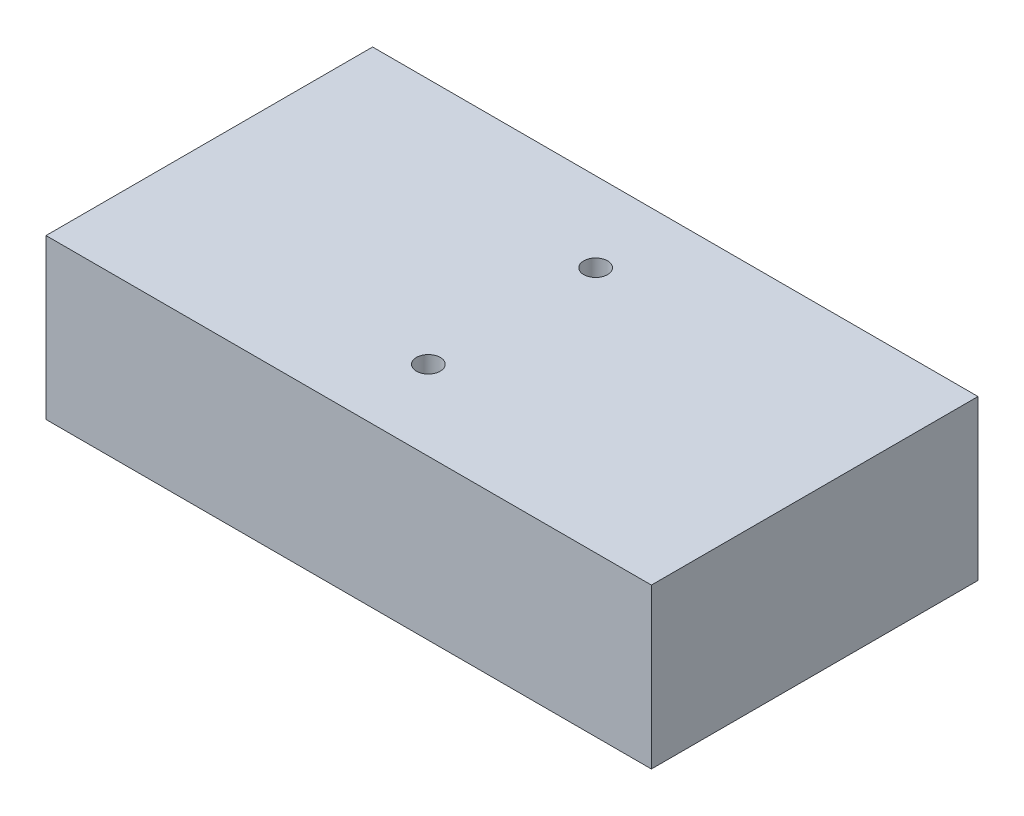
ISO-10303-21;
HEADER;
FILE_DESCRIPTION(('STEP AP214'),'2;1');
FILE_NAME('part.step','',(''),(''),'','','');
FILE_SCHEMA(('AUTOMOTIVE_DESIGN { 1 0 10303 214 1 1 1 1 }'));
ENDSEC;
DATA;
#1=APPLICATION_CONTEXT('core data for automotive mechanical design processes');
#2=APPLICATION_PROTOCOL_DEFINITION('international standard','automotive_design',2000,#1);
#3=PRODUCT_CONTEXT('',#1,'mechanical');
#4=PRODUCT('Part','Part','',(#3));
#5=PRODUCT_RELATED_PRODUCT_CATEGORY('part','',(#4));
#6=PRODUCT_DEFINITION_FORMATION('','',#4);
#7=PRODUCT_DEFINITION_CONTEXT('part definition',#1,'design');
#8=PRODUCT_DEFINITION('design','',#6,#7);
#9=PRODUCT_DEFINITION_SHAPE('','',#8);
#10=(LENGTH_UNIT() NAMED_UNIT(*) SI_UNIT(.MILLI.,.METRE.));
#11=(NAMED_UNIT(*) PLANE_ANGLE_UNIT() SI_UNIT($,.RADIAN.));
#12=(NAMED_UNIT(*) SI_UNIT($,.STERADIAN.) SOLID_ANGLE_UNIT());
#13=UNCERTAINTY_MEASURE_WITH_UNIT(LENGTH_MEASURE(1.E-05),#10,'distance_accuracy_value','');
#14=(GEOMETRIC_REPRESENTATION_CONTEXT(3) GLOBAL_UNCERTAINTY_ASSIGNED_CONTEXT((#13)) GLOBAL_UNIT_ASSIGNED_CONTEXT((#10,
#11,#12)) REPRESENTATION_CONTEXT('',''));
#15=CARTESIAN_POINT('',(0.,0.,0.));
#16=DIRECTION('',(0.,0.,1.));
#17=DIRECTION('',(1.,0.,0.));
#18=AXIS2_PLACEMENT_3D('',#15,#16,#17);
#19=CARTESIAN_POINT('',(0.,20.,0.));
#20=DIRECTION('',(0.,1.,0.));
#21=DIRECTION('',(0.,0.,1.));
#22=AXIS2_PLACEMENT_3D('',#19,#20,#21);
#23=PLANE('',#22);
#24=CARTESIAN_POINT('',(5.45691906005221,20.,-1.26109660574412));
#25=DIRECTION('',(0.,1.,0.));
#26=DIRECTION('',(0.,0.,1.));
#27=AXIS2_PLACEMENT_3D('',#24,#25,#26);
#28=CIRCLE('',#27,1.5);
#29=CARTESIAN_POINT('',(5.45691906005221,20.,0.238903394255881));
#30=VERTEX_POINT('',#29);
#31=EDGE_CURVE('E104',#30,#30,#28,.T.);
#32=ORIENTED_EDGE('',*,*,#31,.F.);
#33=EDGE_LOOP('',(#32));
#34=FACE_BOUND('',#33,.T.);
#35=DIRECTION('',(0.,0.,1.));
#36=VECTOR('',#35,1.);
#37=CARTESIAN_POINT('',(-32.5430809399478,20.,-11.2610966057441));
#38=LINE('',#37,#36);
#39=CARTESIAN_POINT('',(-32.5430809399478,20.,-11.2610966057441));
#40=VERTEX_POINT('',#39);
#41=CARTESIAN_POINT('',(-32.5430809399478,20.,29.7389033942559));
#42=VERTEX_POINT('',#41);
#43=EDGE_CURVE('E89',#40,#42,#38,.T.);
#44=ORIENTED_EDGE('',*,*,#43,.T.);
#45=DIRECTION('',(1.,0.,0.));
#46=VECTOR('',#45,1.);
#47=CARTESIAN_POINT('',(-32.5430809399478,20.,29.7389033942559));
#48=LINE('',#47,#46);
#49=CARTESIAN_POINT('',(43.4569190600522,20.,29.7389033942559));
#50=VERTEX_POINT('',#49);
#51=EDGE_CURVE('E84',#42,#50,#48,.T.);
#52=ORIENTED_EDGE('',*,*,#51,.T.);
#53=DIRECTION('',(0.,0.,-1.));
#54=VECTOR('',#53,1.);
#55=CARTESIAN_POINT('',(43.4569190600522,20.,-11.2610966057441));
#56=LINE('',#55,#54);
#57=CARTESIAN_POINT('',(43.4569190600522,20.,-11.2610966057441));
#58=VERTEX_POINT('',#57);
#59=EDGE_CURVE('E87',#50,#58,#56,.T.);
#60=ORIENTED_EDGE('',*,*,#59,.T.);
#61=DIRECTION('',(-1.,0.,0.));
#62=VECTOR('',#61,1.);
#63=CARTESIAN_POINT('',(-32.5430809399478,20.,-11.2610966057441));
#64=LINE('',#63,#62);
#65=EDGE_CURVE('E54',#58,#40,#64,.T.);
#66=ORIENTED_EDGE('',*,*,#65,.T.);
#67=EDGE_LOOP('',(#44,#52,#60,#66));
#68=FACE_BOUND('',#67,.T.);
#69=CARTESIAN_POINT('',(5.45691906005221,20.,19.7389033942559));
#70=DIRECTION('',(0.,1.,0.));
#71=DIRECTION('',(0.,0.,1.));
#72=AXIS2_PLACEMENT_3D('',#69,#70,#71);
#73=CIRCLE('',#72,1.5);
#74=CARTESIAN_POINT('',(5.45691906005221,20.,21.2389033942559));
#75=VERTEX_POINT('',#74);
#76=EDGE_CURVE('E119',#75,#75,#73,.T.);
#77=ORIENTED_EDGE('',*,*,#76,.F.);
#78=EDGE_LOOP('',(#77));
#79=FACE_BOUND('',#78,.T.);
#80=ADVANCED_FACE('F37',(#34,#68,#79),#23,.T.);
#81=CARTESIAN_POINT('',(0.,0.,0.));
#82=DIRECTION('',(0.,1.,0.));
#83=DIRECTION('',(0.,0.,1.));
#84=AXIS2_PLACEMENT_3D('',#81,#82,#83);
#85=PLANE('',#84);
#86=DIRECTION('',(0.,0.,1.));
#87=VECTOR('',#86,1.);
#88=CARTESIAN_POINT('',(-32.5430809399478,0.,-11.2610966057441));
#89=LINE('',#88,#87);
#90=CARTESIAN_POINT('',(-32.5430809399478,0.,-11.2610966057441));
#91=VERTEX_POINT('',#90);
#92=CARTESIAN_POINT('',(-32.5430809399478,0.,29.7389033942559));
#93=VERTEX_POINT('',#92);
#94=EDGE_CURVE('E101',#91,#93,#89,.T.);
#95=ORIENTED_EDGE('',*,*,#94,.F.);
#96=DIRECTION('',(-1.,0.,0.));
#97=VECTOR('',#96,1.);
#98=CARTESIAN_POINT('',(-32.5430809399478,0.,-11.2610966057441));
#99=LINE('',#98,#97);
#100=CARTESIAN_POINT('',(43.4569190600522,0.,-11.2610966057441));
#101=VERTEX_POINT('',#100);
#102=EDGE_CURVE('E77',#101,#91,#99,.T.);
#103=ORIENTED_EDGE('',*,*,#102,.F.);
#104=DIRECTION('',(0.,0.,-1.));
#105=VECTOR('',#104,1.);
#106=CARTESIAN_POINT('',(43.4569190600522,0.,-11.2610966057441));
#107=LINE('',#106,#105);
#108=CARTESIAN_POINT('',(43.4569190600522,0.,29.7389033942559));
#109=VERTEX_POINT('',#108);
#110=EDGE_CURVE('E71',#109,#101,#107,.T.);
#111=ORIENTED_EDGE('',*,*,#110,.F.);
#112=DIRECTION('',(1.,0.,0.));
#113=VECTOR('',#112,1.);
#114=CARTESIAN_POINT('',(-32.5430809399478,0.,29.7389033942559));
#115=LINE('',#114,#113);
#116=EDGE_CURVE('E93',#93,#109,#115,.T.);
#117=ORIENTED_EDGE('',*,*,#116,.F.);
#118=EDGE_LOOP('',(#95,#103,#111,#117));
#119=FACE_BOUND('',#118,.T.);
#120=CARTESIAN_POINT('',(5.45691906005221,0.,-1.26109660574412));
#121=DIRECTION('',(0.,1.,0.));
#122=DIRECTION('',(0.,0.,1.));
#123=AXIS2_PLACEMENT_3D('',#120,#121,#122);
#124=CIRCLE('',#123,1.5);
#125=CARTESIAN_POINT('',(5.45691906005221,0.,0.238903394255881));
#126=VERTEX_POINT('',#125);
#127=EDGE_CURVE('E116',#126,#126,#124,.T.);
#128=ORIENTED_EDGE('',*,*,#127,.T.);
#129=EDGE_LOOP('',(#128));
#130=FACE_BOUND('',#129,.T.);
#131=CARTESIAN_POINT('',(5.45691906005221,0.,19.7389033942559));
#132=DIRECTION('',(0.,1.,0.));
#133=DIRECTION('',(0.,0.,1.));
#134=AXIS2_PLACEMENT_3D('',#131,#132,#133);
#135=CIRCLE('',#134,1.5);
#136=CARTESIAN_POINT('',(5.45691906005221,0.,21.2389033942559));
#137=VERTEX_POINT('',#136);
#138=EDGE_CURVE('E122',#137,#137,#135,.T.);
#139=ORIENTED_EDGE('',*,*,#138,.T.);
#140=EDGE_LOOP('',(#139));
#141=FACE_BOUND('',#140,.T.);
#142=ADVANCED_FACE('F112',(#119,#130,#141),#85,.F.);
#143=CARTESIAN_POINT('',(-32.5430809399478,20.,-11.2610966057441));
#144=DIRECTION('',(1.,0.,0.));
#145=DIRECTION('',(0.,0.,-1.));
#146=AXIS2_PLACEMENT_3D('',#143,#144,#145);
#147=PLANE('',#146);
#148=ORIENTED_EDGE('',*,*,#94,.T.);
#149=DIRECTION('',(0.,-1.,0.));
#150=VECTOR('',#149,1.);
#151=CARTESIAN_POINT('',(-32.5430809399478,20.,29.7389033942559));
#152=LINE('',#151,#150);
#153=EDGE_CURVE('E11',#42,#93,#152,.T.);
#154=ORIENTED_EDGE('',*,*,#153,.F.);
#155=ORIENTED_EDGE('',*,*,#43,.F.);
#156=DIRECTION('',(0.,-1.,0.));
#157=VECTOR('',#156,1.);
#158=CARTESIAN_POINT('',(-32.5430809399478,20.,-11.2610966057441));
#159=LINE('',#158,#157);
#160=EDGE_CURVE('E97',#40,#91,#159,.T.);
#161=ORIENTED_EDGE('',*,*,#160,.T.);
#162=EDGE_LOOP('',(#148,#154,#155,#161));
#163=FACE_BOUND('',#162,.T.);
#164=ADVANCED_FACE('F39',(#163),#147,.F.);
#165=CARTESIAN_POINT('',(-32.5430809399478,20.,29.7389033942559));
#166=DIRECTION('',(0.,0.,-1.));
#167=DIRECTION('',(-1.,0.,0.));
#168=AXIS2_PLACEMENT_3D('',#165,#166,#167);
#169=PLANE('',#168);
#170=ORIENTED_EDGE('',*,*,#116,.T.);
#171=DIRECTION('',(0.,-1.,0.));
#172=VECTOR('',#171,1.);
#173=CARTESIAN_POINT('',(43.4569190600522,20.,29.7389033942559));
#174=LINE('',#173,#172);
#175=EDGE_CURVE('E46',#50,#109,#174,.T.);
#176=ORIENTED_EDGE('',*,*,#175,.F.);
#177=ORIENTED_EDGE('',*,*,#51,.F.);
#178=ORIENTED_EDGE('',*,*,#153,.T.);
#179=EDGE_LOOP('',(#170,#176,#177,#178));
#180=FACE_BOUND('',#179,.T.);
#181=ADVANCED_FACE('F92',(#180),#169,.F.);
#182=CARTESIAN_POINT('',(43.4569190600522,20.,-11.2610966057441));
#183=DIRECTION('',(-1.,0.,0.));
#184=DIRECTION('',(0.,0.,1.));
#185=AXIS2_PLACEMENT_3D('',#182,#183,#184);
#186=PLANE('',#185);
#187=ORIENTED_EDGE('',*,*,#110,.T.);
#188=DIRECTION('',(0.,-1.,0.));
#189=VECTOR('',#188,1.);
#190=CARTESIAN_POINT('',(43.4569190600522,20.,-11.2610966057441));
#191=LINE('',#190,#189);
#192=EDGE_CURVE('E94',#58,#101,#191,.T.);
#193=ORIENTED_EDGE('',*,*,#192,.F.);
#194=ORIENTED_EDGE('',*,*,#59,.F.);
#195=ORIENTED_EDGE('',*,*,#175,.T.);
#196=EDGE_LOOP('',(#187,#193,#194,#195));
#197=FACE_BOUND('',#196,.T.);
#198=ADVANCED_FACE('F95',(#197),#186,.F.);
#199=CARTESIAN_POINT('',(-32.5430809399478,20.,-11.2610966057441));
#200=DIRECTION('',(0.,0.,1.));
#201=DIRECTION('',(1.,0.,0.));
#202=AXIS2_PLACEMENT_3D('',#199,#200,#201);
#203=PLANE('',#202);
#204=ORIENTED_EDGE('',*,*,#102,.T.);
#205=ORIENTED_EDGE('',*,*,#160,.F.);
#206=ORIENTED_EDGE('',*,*,#65,.F.);
#207=ORIENTED_EDGE('',*,*,#192,.T.);
#208=EDGE_LOOP('',(#204,#205,#206,#207));
#209=FACE_BOUND('',#208,.T.);
#210=ADVANCED_FACE('F109',(#209),#203,.F.);
#211=CARTESIAN_POINT('',(5.45691906005221,20.,-1.26109660574412));
#212=DIRECTION('',(0.,-1.,0.));
#213=DIRECTION('',(0.,0.,-1.));
#214=AXIS2_PLACEMENT_3D('',#211,#212,#213);
#215=CYLINDRICAL_SURFACE('',#214,1.5);
#216=ORIENTED_EDGE('',*,*,#31,.T.);
#217=EDGE_LOOP('',(#216));
#218=FACE_BOUND('',#217,.T.);
#219=ORIENTED_EDGE('',*,*,#127,.F.);
#220=EDGE_LOOP('',(#219));
#221=FACE_BOUND('',#220,.T.);
#222=ADVANCED_FACE('F139',(#218,#221),#215,.F.);
#223=CARTESIAN_POINT('',(5.45691906005221,20.,19.7389033942559));
#224=DIRECTION('',(0.,-1.,0.));
#225=DIRECTION('',(0.,0.,-1.));
#226=AXIS2_PLACEMENT_3D('',#223,#224,#225);
#227=CYLINDRICAL_SURFACE('',#226,1.5);
#228=ORIENTED_EDGE('',*,*,#76,.T.);
#229=EDGE_LOOP('',(#228));
#230=FACE_BOUND('',#229,.T.);
#231=ORIENTED_EDGE('',*,*,#138,.F.);
#232=EDGE_LOOP('',(#231));
#233=FACE_BOUND('',#232,.T.);
#234=ADVANCED_FACE('F128',(#230,#233),#227,.F.);
#235=CLOSED_SHELL('',(#80,#142,#164,#181,#198,#210,#222,#234));
#236=MANIFOLD_SOLID_BREP('B2',#235);
#237=ADVANCED_BREP_SHAPE_REPRESENTATION('',(#18,#236),#14);
#238=SHAPE_DEFINITION_REPRESENTATION(#9,#237);
ENDSEC;
END-ISO-10303-21;
